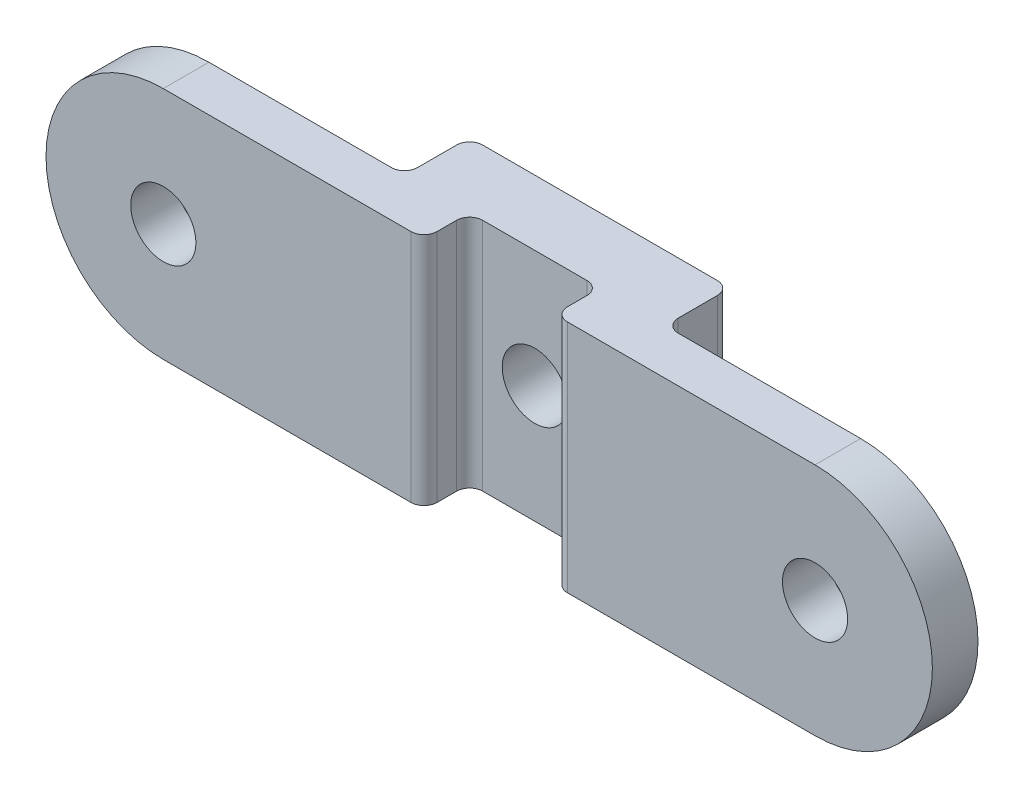
ISO-10303-21;
HEADER;
FILE_DESCRIPTION(('STEP AP214'),'2;1');
FILE_NAME('part.step','',(''),(''),'','','');
FILE_SCHEMA(('AUTOMOTIVE_DESIGN { 1 0 10303 214 1 1 1 1 }'));
ENDSEC;
DATA;
#1=APPLICATION_CONTEXT('core data for automotive mechanical design processes');
#2=APPLICATION_PROTOCOL_DEFINITION('international standard','automotive_design',2000,#1);
#3=PRODUCT_CONTEXT('',#1,'mechanical');
#4=PRODUCT('Part','Part','',(#3));
#5=PRODUCT_RELATED_PRODUCT_CATEGORY('part','',(#4));
#6=PRODUCT_DEFINITION_FORMATION('','',#4);
#7=PRODUCT_DEFINITION_CONTEXT('part definition',#1,'design');
#8=PRODUCT_DEFINITION('design','',#6,#7);
#9=PRODUCT_DEFINITION_SHAPE('','',#8);
#10=(LENGTH_UNIT() NAMED_UNIT(*) SI_UNIT(.MILLI.,.METRE.));
#11=(NAMED_UNIT(*) PLANE_ANGLE_UNIT() SI_UNIT($,.RADIAN.));
#12=(NAMED_UNIT(*) SI_UNIT($,.STERADIAN.) SOLID_ANGLE_UNIT());
#13=UNCERTAINTY_MEASURE_WITH_UNIT(LENGTH_MEASURE(1.E-05),#10,'distance_accuracy_value','');
#14=(GEOMETRIC_REPRESENTATION_CONTEXT(3) GLOBAL_UNCERTAINTY_ASSIGNED_CONTEXT((#13)) GLOBAL_UNIT_ASSIGNED_CONTEXT((#10,
#11,#12)) REPRESENTATION_CONTEXT('',''));
#15=CARTESIAN_POINT('',(0.,0.,0.));
#16=DIRECTION('',(0.,0.,1.));
#17=DIRECTION('',(1.,0.,0.));
#18=AXIS2_PLACEMENT_3D('',#15,#16,#17);
#19=CARTESIAN_POINT('',(-10.,9.,5.));
#20=DIRECTION('',(0.,-1.,0.));
#21=DIRECTION('',(0.,0.,-1.));
#22=AXIS2_PLACEMENT_3D('',#19,#20,#21);
#23=PLANE('',#22);
#24=DIRECTION('',(0.,0.,1.));
#25=VECTOR('',#24,1.);
#26=CARTESIAN_POINT('',(-25.,9.,-1.5));
#27=LINE('',#26,#25);
#28=CARTESIAN_POINT('',(-25.,8.99999999999999,5.));
#29=VERTEX_POINT('',#28);
#30=CARTESIAN_POINT('',(-25.,9.,8.5));
#31=VERTEX_POINT('',#30);
#32=EDGE_CURVE('E50',#29,#31,#27,.T.);
#33=ORIENTED_EDGE('',*,*,#32,.T.);
#34=DIRECTION('',(-1.,0.,0.));
#35=VECTOR('',#34,1.);
#36=CARTESIAN_POINT('',(-35.,9.,8.5));
#37=LINE('',#36,#35);
#38=CARTESIAN_POINT('',(-6.,9.,8.5));
#39=VERTEX_POINT('',#38);
#40=EDGE_CURVE('E210',#39,#31,#37,.T.);
#41=ORIENTED_EDGE('',*,*,#40,.F.);
#42=CARTESIAN_POINT('',(-6.,9.,7.5));
#43=DIRECTION('',(0.,-1.,0.));
#44=DIRECTION('',(0.,0.,-1.));
#45=AXIS2_PLACEMENT_3D('',#42,#43,#44);
#46=CIRCLE('',#45,1.);
#47=CARTESIAN_POINT('',(-5.,9.,7.5));
#48=VERTEX_POINT('',#47);
#49=EDGE_CURVE('E280',#39,#48,#46,.F.);
#50=ORIENTED_EDGE('',*,*,#49,.T.);
#51=DIRECTION('',(0.,0.,1.));
#52=VECTOR('',#51,1.);
#53=CARTESIAN_POINT('',(-5.,9.,5.));
#54=LINE('',#53,#52);
#55=CARTESIAN_POINT('',(-5.,9.,6.));
#56=VERTEX_POINT('',#55);
#57=EDGE_CURVE('E206',#56,#48,#54,.T.);
#58=ORIENTED_EDGE('',*,*,#57,.F.);
#59=CARTESIAN_POINT('',(-4.,9.,6.));
#60=DIRECTION('',(0.,-1.,0.));
#61=DIRECTION('',(0.,0.,-1.));
#62=AXIS2_PLACEMENT_3D('',#59,#60,#61);
#63=CIRCLE('',#62,1.);
#64=CARTESIAN_POINT('',(-4.,9.,5.));
#65=VERTEX_POINT('',#64);
#66=EDGE_CURVE('E315',#56,#65,#63,.T.);
#67=ORIENTED_EDGE('',*,*,#66,.T.);
#68=DIRECTION('',(-1.,0.,0.));
#69=VECTOR('',#68,1.);
#70=CARTESIAN_POINT('',(-10.,9.,5.));
#71=LINE('',#70,#69);
#72=CARTESIAN_POINT('',(4.,9.,5.));
#73=VERTEX_POINT('',#72);
#74=EDGE_CURVE('E226',#73,#65,#71,.T.);
#75=ORIENTED_EDGE('',*,*,#74,.F.);
#76=CARTESIAN_POINT('',(4.,9.,6.));
#77=DIRECTION('',(0.,-1.,0.));
#78=DIRECTION('',(0.,0.,-1.));
#79=AXIS2_PLACEMENT_3D('',#76,#77,#78);
#80=CIRCLE('',#79,1.);
#81=CARTESIAN_POINT('',(5.,9.,6.));
#82=VERTEX_POINT('',#81);
#83=EDGE_CURVE('E44',#73,#82,#80,.T.);
#84=ORIENTED_EDGE('',*,*,#83,.T.);
#85=DIRECTION('',(0.,0.,-1.));
#86=VECTOR('',#85,1.);
#87=CARTESIAN_POINT('',(5.,9.,5.));
#88=LINE('',#87,#86);
#89=CARTESIAN_POINT('',(5.,9.,7.5));
#90=VERTEX_POINT('',#89);
#91=EDGE_CURVE('E324',#90,#82,#88,.T.);
#92=ORIENTED_EDGE('',*,*,#91,.F.);
#93=CARTESIAN_POINT('',(5.99999999999999,9.,7.5));
#94=DIRECTION('',(0.,-1.,0.));
#95=DIRECTION('',(0.,0.,-1.));
#96=AXIS2_PLACEMENT_3D('',#93,#94,#95);
#97=CIRCLE('',#96,1.);
#98=CARTESIAN_POINT('',(5.99999999999999,9.,8.5));
#99=VERTEX_POINT('',#98);
#100=EDGE_CURVE('E277',#90,#99,#97,.F.);
#101=ORIENTED_EDGE('',*,*,#100,.T.);
#102=DIRECTION('',(-1.,0.,0.));
#103=VECTOR('',#102,1.);
#104=CARTESIAN_POINT('',(35.,9.,8.5));
#105=LINE('',#104,#103);
#106=CARTESIAN_POINT('',(25.,9.,8.5));
#107=VERTEX_POINT('',#106);
#108=EDGE_CURVE('E203',#107,#99,#105,.T.);
#109=ORIENTED_EDGE('',*,*,#108,.F.);
#110=DIRECTION('',(0.,0.,1.));
#111=VECTOR('',#110,1.);
#112=CARTESIAN_POINT('',(25.,9.,-1.5));
#113=LINE('',#112,#111);
#114=CARTESIAN_POINT('',(25.,9.,5.));
#115=VERTEX_POINT('',#114);
#116=EDGE_CURVE('E58',#115,#107,#113,.T.);
#117=ORIENTED_EDGE('',*,*,#116,.F.);
#118=DIRECTION('',(1.,0.,0.));
#119=VECTOR('',#118,1.);
#120=CARTESIAN_POINT('',(35.,9.,5.));
#121=LINE('',#120,#119);
#122=CARTESIAN_POINT('',(11.,9.,5.));
#123=VERTEX_POINT('',#122);
#124=EDGE_CURVE('E199',#123,#115,#121,.T.);
#125=ORIENTED_EDGE('',*,*,#124,.F.);
#126=CARTESIAN_POINT('',(11.,9.,4.));
#127=DIRECTION('',(0.,-1.,0.));
#128=DIRECTION('',(0.,0.,-1.));
#129=AXIS2_PLACEMENT_3D('',#126,#127,#128);
#130=CIRCLE('',#129,1.);
#131=CARTESIAN_POINT('',(10.,9.,4.));
#132=VERTEX_POINT('',#131);
#133=EDGE_CURVE('E304',#123,#132,#130,.T.);
#134=ORIENTED_EDGE('',*,*,#133,.T.);
#135=DIRECTION('',(0.,0.,-1.));
#136=VECTOR('',#135,1.);
#137=CARTESIAN_POINT('',(10.,9.,5.));
#138=LINE('',#137,#136);
#139=CARTESIAN_POINT('',(10.,9.,1.));
#140=VERTEX_POINT('',#139);
#141=EDGE_CURVE('E246',#132,#140,#138,.T.);
#142=ORIENTED_EDGE('',*,*,#141,.T.);
#143=CARTESIAN_POINT('',(9.,9.,1.));
#144=DIRECTION('',(0.,-1.,0.));
#145=DIRECTION('',(0.,0.,-1.));
#146=AXIS2_PLACEMENT_3D('',#143,#144,#145);
#147=CIRCLE('',#146,1.);
#148=CARTESIAN_POINT('',(9.,9.,0.));
#149=VERTEX_POINT('',#148);
#150=EDGE_CURVE('E282',#140,#149,#147,.F.);
#151=ORIENTED_EDGE('',*,*,#150,.T.);
#152=DIRECTION('',(-1.,0.,0.));
#153=VECTOR('',#152,1.);
#154=CARTESIAN_POINT('',(-10.,9.,0.));
#155=LINE('',#154,#153);
#156=CARTESIAN_POINT('',(-9.,9.,0.));
#157=VERTEX_POINT('',#156);
#158=EDGE_CURVE('E223',#149,#157,#155,.T.);
#159=ORIENTED_EDGE('',*,*,#158,.T.);
#160=CARTESIAN_POINT('',(-9.,9.,1.));
#161=DIRECTION('',(0.,-1.,0.));
#162=DIRECTION('',(0.,0.,-1.));
#163=AXIS2_PLACEMENT_3D('',#160,#161,#162);
#164=CIRCLE('',#163,1.);
#165=CARTESIAN_POINT('',(-10.,9.,1.));
#166=VERTEX_POINT('',#165);
#167=EDGE_CURVE('E284',#157,#166,#164,.F.);
#168=ORIENTED_EDGE('',*,*,#167,.T.);
#169=DIRECTION('',(0.,0.,-1.));
#170=VECTOR('',#169,1.);
#171=CARTESIAN_POINT('',(-10.,9.,5.));
#172=LINE('',#171,#170);
#173=CARTESIAN_POINT('',(-10.,9.,4.));
#174=VERTEX_POINT('',#173);
#175=EDGE_CURVE('E243',#174,#166,#172,.T.);
#176=ORIENTED_EDGE('',*,*,#175,.F.);
#177=CARTESIAN_POINT('',(-11.,9.,4.));
#178=DIRECTION('',(0.,-1.,0.));
#179=DIRECTION('',(0.,0.,-1.));
#180=AXIS2_PLACEMENT_3D('',#177,#178,#179);
#181=CIRCLE('',#180,1.);
#182=CARTESIAN_POINT('',(-11.,9.,5.));
#183=VERTEX_POINT('',#182);
#184=EDGE_CURVE('E310',#174,#183,#181,.T.);
#185=ORIENTED_EDGE('',*,*,#184,.T.);
#186=DIRECTION('',(1.,0.,0.));
#187=VECTOR('',#186,1.);
#188=CARTESIAN_POINT('',(-35.,9.,5.));
#189=LINE('',#188,#187);
#190=EDGE_CURVE('E204',#29,#183,#189,.T.);
#191=ORIENTED_EDGE('',*,*,#190,.F.);
#192=EDGE_LOOP('',(#33,#41,#50,#58,#67,#75,#84,#92,#101,#109,#117,#125,#134,#142,#151,#159,#168,
#176,#185,#191));
#193=FACE_BOUND('',#192,.T.);
#194=ADVANCED_FACE('F36',(#193),#23,.F.);
#195=CARTESIAN_POINT('',(-10.,-9.,5.));
#196=DIRECTION('',(0.,1.,0.));
#197=DIRECTION('',(0.,0.,1.));
#198=AXIS2_PLACEMENT_3D('',#195,#196,#197);
#199=PLANE('',#198);
#200=DIRECTION('',(-1.,0.,0.));
#201=VECTOR('',#200,1.);
#202=CARTESIAN_POINT('',(-35.,-9.,8.5));
#203=LINE('',#202,#201);
#204=CARTESIAN_POINT('',(-6.,-9.,8.5));
#205=VERTEX_POINT('',#204);
#206=CARTESIAN_POINT('',(-25.,-9.00000000000001,8.5));
#207=VERTEX_POINT('',#206);
#208=EDGE_CURVE('E207',#205,#207,#203,.T.);
#209=ORIENTED_EDGE('',*,*,#208,.T.);
#210=DIRECTION('',(0.,0.,1.));
#211=VECTOR('',#210,1.);
#212=CARTESIAN_POINT('',(-25.,-9.00000000000001,-1.5));
#213=LINE('',#212,#211);
#214=CARTESIAN_POINT('',(-25.,-9.00000000000001,5.));
#215=VERTEX_POINT('',#214);
#216=EDGE_CURVE('E359',#215,#207,#213,.T.);
#217=ORIENTED_EDGE('',*,*,#216,.F.);
#218=DIRECTION('',(1.,0.,0.));
#219=VECTOR('',#218,1.);
#220=CARTESIAN_POINT('',(-35.,-9.,5.));
#221=LINE('',#220,#219);
#222=CARTESIAN_POINT('',(-11.,-9.,5.));
#223=VERTEX_POINT('',#222);
#224=EDGE_CURVE('E214',#215,#223,#221,.T.);
#225=ORIENTED_EDGE('',*,*,#224,.T.);
#226=CARTESIAN_POINT('',(-11.,-9.,4.));
#227=DIRECTION('',(0.,1.,0.));
#228=DIRECTION('',(0.,0.,1.));
#229=AXIS2_PLACEMENT_3D('',#226,#227,#228);
#230=CIRCLE('',#229,1.);
#231=CARTESIAN_POINT('',(-10.,-9.,4.));
#232=VERTEX_POINT('',#231);
#233=EDGE_CURVE('E308',#223,#232,#230,.T.);
#234=ORIENTED_EDGE('',*,*,#233,.T.);
#235=DIRECTION('',(0.,0.,-1.));
#236=VECTOR('',#235,1.);
#237=CARTESIAN_POINT('',(-10.,-9.,5.));
#238=LINE('',#237,#236);
#239=CARTESIAN_POINT('',(-10.,-9.,1.));
#240=VERTEX_POINT('',#239);
#241=EDGE_CURVE('E240',#232,#240,#238,.T.);
#242=ORIENTED_EDGE('',*,*,#241,.T.);
#243=CARTESIAN_POINT('',(-9.,-9.,1.));
#244=DIRECTION('',(0.,1.,0.));
#245=DIRECTION('',(0.,0.,1.));
#246=AXIS2_PLACEMENT_3D('',#243,#244,#245);
#247=CIRCLE('',#246,1.);
#248=CARTESIAN_POINT('',(-9.,-9.,0.));
#249=VERTEX_POINT('',#248);
#250=EDGE_CURVE('E271',#240,#249,#247,.F.);
#251=ORIENTED_EDGE('',*,*,#250,.T.);
#252=DIRECTION('',(1.,0.,0.));
#253=VECTOR('',#252,1.);
#254=CARTESIAN_POINT('',(-10.,-9.,0.));
#255=LINE('',#254,#253);
#256=CARTESIAN_POINT('',(9.,-9.,0.));
#257=VERTEX_POINT('',#256);
#258=EDGE_CURVE('E230',#249,#257,#255,.T.);
#259=ORIENTED_EDGE('',*,*,#258,.T.);
#260=CARTESIAN_POINT('',(9.,-9.,1.));
#261=DIRECTION('',(0.,1.,0.));
#262=DIRECTION('',(0.,0.,1.));
#263=AXIS2_PLACEMENT_3D('',#260,#261,#262);
#264=CIRCLE('',#263,1.);
#265=CARTESIAN_POINT('',(10.,-9.,1.));
#266=VERTEX_POINT('',#265);
#267=EDGE_CURVE('E269',#257,#266,#264,.F.);
#268=ORIENTED_EDGE('',*,*,#267,.T.);
#269=DIRECTION('',(0.,0.,-1.));
#270=VECTOR('',#269,1.);
#271=CARTESIAN_POINT('',(10.,-9.,5.));
#272=LINE('',#271,#270);
#273=CARTESIAN_POINT('',(10.,-9.,4.));
#274=VERTEX_POINT('',#273);
#275=EDGE_CURVE('E233',#274,#266,#272,.T.);
#276=ORIENTED_EDGE('',*,*,#275,.F.);
#277=CARTESIAN_POINT('',(11.,-9.,4.));
#278=DIRECTION('',(0.,1.,0.));
#279=DIRECTION('',(0.,0.,1.));
#280=AXIS2_PLACEMENT_3D('',#277,#278,#279);
#281=CIRCLE('',#280,1.);
#282=CARTESIAN_POINT('',(11.,-9.,5.));
#283=VERTEX_POINT('',#282);
#284=EDGE_CURVE('E306',#274,#283,#281,.T.);
#285=ORIENTED_EDGE('',*,*,#284,.T.);
#286=DIRECTION('',(1.,0.,0.));
#287=VECTOR('',#286,1.);
#288=CARTESIAN_POINT('',(35.,-9.,5.));
#289=LINE('',#288,#287);
#290=CARTESIAN_POINT('',(25.,-9.00000000000001,5.));
#291=VERTEX_POINT('',#290);
#292=EDGE_CURVE('E185',#283,#291,#289,.T.);
#293=ORIENTED_EDGE('',*,*,#292,.T.);
#294=DIRECTION('',(0.,0.,1.));
#295=VECTOR('',#294,1.);
#296=CARTESIAN_POINT('',(25.,-9.00000000000001,-1.5));
#297=LINE('',#296,#295);
#298=CARTESIAN_POINT('',(25.,-9.00000000000001,8.5));
#299=VERTEX_POINT('',#298);
#300=EDGE_CURVE('E172',#291,#299,#297,.T.);
#301=ORIENTED_EDGE('',*,*,#300,.T.);
#302=DIRECTION('',(-1.,0.,0.));
#303=VECTOR('',#302,1.);
#304=CARTESIAN_POINT('',(35.,-9.,8.5));
#305=LINE('',#304,#303);
#306=CARTESIAN_POINT('',(5.99999999999999,-9.,8.5));
#307=VERTEX_POINT('',#306);
#308=EDGE_CURVE('E182',#299,#307,#305,.T.);
#309=ORIENTED_EDGE('',*,*,#308,.T.);
#310=CARTESIAN_POINT('',(5.99999999999999,-9.,7.5));
#311=DIRECTION('',(0.,1.,0.));
#312=DIRECTION('',(0.,0.,1.));
#313=AXIS2_PLACEMENT_3D('',#310,#311,#312);
#314=CIRCLE('',#313,1.);
#315=CARTESIAN_POINT('',(5.,-9.,7.5));
#316=VERTEX_POINT('',#315);
#317=EDGE_CURVE('E265',#307,#316,#314,.F.);
#318=ORIENTED_EDGE('',*,*,#317,.T.);
#319=DIRECTION('',(0.,0.,-1.));
#320=VECTOR('',#319,1.);
#321=CARTESIAN_POINT('',(5.,-9.,5.));
#322=LINE('',#321,#320);
#323=CARTESIAN_POINT('',(5.,-9.,6.));
#324=VERTEX_POINT('',#323);
#325=EDGE_CURVE('E191',#316,#324,#322,.T.);
#326=ORIENTED_EDGE('',*,*,#325,.T.);
#327=CARTESIAN_POINT('',(4.,-9.,6.));
#328=DIRECTION('',(0.,1.,0.));
#329=DIRECTION('',(0.,0.,1.));
#330=AXIS2_PLACEMENT_3D('',#327,#328,#329);
#331=CIRCLE('',#330,1.);
#332=CARTESIAN_POINT('',(4.,-9.,5.));
#333=VERTEX_POINT('',#332);
#334=EDGE_CURVE('E317',#324,#333,#331,.T.);
#335=ORIENTED_EDGE('',*,*,#334,.T.);
#336=DIRECTION('',(1.,0.,0.));
#337=VECTOR('',#336,1.);
#338=CARTESIAN_POINT('',(-10.,-9.,5.));
#339=LINE('',#338,#337);
#340=CARTESIAN_POINT('',(-4.,-9.,5.));
#341=VERTEX_POINT('',#340);
#342=EDGE_CURVE('E229',#341,#333,#339,.T.);
#343=ORIENTED_EDGE('',*,*,#342,.F.);
#344=CARTESIAN_POINT('',(-4.,-9.,6.));
#345=DIRECTION('',(0.,1.,0.));
#346=DIRECTION('',(0.,0.,1.));
#347=AXIS2_PLACEMENT_3D('',#344,#345,#346);
#348=CIRCLE('',#347,1.);
#349=CARTESIAN_POINT('',(-5.,-9.,6.));
#350=VERTEX_POINT('',#349);
#351=EDGE_CURVE('E313',#341,#350,#348,.T.);
#352=ORIENTED_EDGE('',*,*,#351,.T.);
#353=DIRECTION('',(0.,0.,1.));
#354=VECTOR('',#353,1.);
#355=CARTESIAN_POINT('',(-5.,-9.,5.));
#356=LINE('',#355,#354);
#357=CARTESIAN_POINT('',(-5.,-9.,7.5));
#358=VERTEX_POINT('',#357);
#359=EDGE_CURVE('E216',#350,#358,#356,.T.);
#360=ORIENTED_EDGE('',*,*,#359,.T.);
#361=CARTESIAN_POINT('',(-6.,-9.,7.5));
#362=DIRECTION('',(0.,1.,0.));
#363=DIRECTION('',(0.,0.,1.));
#364=AXIS2_PLACEMENT_3D('',#361,#362,#363);
#365=CIRCLE('',#364,1.);
#366=EDGE_CURVE('E267',#358,#205,#365,.F.);
#367=ORIENTED_EDGE('',*,*,#366,.T.);
#368=EDGE_LOOP('',(#209,#217,#225,#234,#242,#251,#259,#268,#276,#285,#293,#301,#309,#318,#326,
#335,#343,#352,#360,#367));
#369=FACE_BOUND('',#368,.T.);
#370=ADVANCED_FACE('F181',(#369),#199,.F.);
#371=CARTESIAN_POINT('',(0.,0.,5.));
#372=DIRECTION('',(0.,0.,-1.));
#373=DIRECTION('',(-1.,0.,0.));
#374=AXIS2_PLACEMENT_3D('',#371,#372,#373);
#375=PLANE('',#374);
#376=ORIENTED_EDGE('',*,*,#74,.T.);
#377=DIRECTION('',(0.,-1.,0.));
#378=VECTOR('',#377,1.);
#379=CARTESIAN_POINT('',(-4.,0.,5.));
#380=LINE('',#379,#378);
#381=EDGE_CURVE('E301',#65,#341,#380,.T.);
#382=ORIENTED_EDGE('',*,*,#381,.T.);
#383=ORIENTED_EDGE('',*,*,#342,.T.);
#384=DIRECTION('',(0.,-1.,0.));
#385=VECTOR('',#384,1.);
#386=CARTESIAN_POINT('',(4.,0.,5.));
#387=LINE('',#386,#385);
#388=EDGE_CURVE('E299',#333,#73,#387,.F.);
#389=ORIENTED_EDGE('',*,*,#388,.T.);
#390=EDGE_LOOP('',(#376,#382,#383,#389));
#391=FACE_BOUND('',#390,.T.);
#392=CARTESIAN_POINT('',(0.,0.,5.));
#393=DIRECTION('',(0.,0.,1.));
#394=DIRECTION('',(1.,0.,0.));
#395=AXIS2_PLACEMENT_3D('',#392,#393,#394);
#396=CIRCLE('',#395,2.5);
#397=CARTESIAN_POINT('',(2.5,0.,5.));
#398=VERTEX_POINT('',#397);
#399=EDGE_CURVE('E220',#398,#398,#396,.T.);
#400=ORIENTED_EDGE('',*,*,#399,.F.);
#401=EDGE_LOOP('',(#400));
#402=FACE_BOUND('',#401,.T.);
#403=ADVANCED_FACE('F335',(#391,#402),#375,.F.);
#404=CARTESIAN_POINT('',(0.,0.,0.));
#405=DIRECTION('',(0.,0.,-1.));
#406=DIRECTION('',(-1.,0.,0.));
#407=AXIS2_PLACEMENT_3D('',#404,#405,#406);
#408=PLANE('',#407);
#409=ORIENTED_EDGE('',*,*,#258,.F.);
#410=DIRECTION('',(0.,-1.,0.));
#411=VECTOR('',#410,1.);
#412=CARTESIAN_POINT('',(-9.,9.,0.));
#413=LINE('',#412,#411);
#414=EDGE_CURVE('E275',#249,#157,#413,.F.);
#415=ORIENTED_EDGE('',*,*,#414,.T.);
#416=ORIENTED_EDGE('',*,*,#158,.F.);
#417=DIRECTION('',(0.,1.,0.));
#418=VECTOR('',#417,1.);
#419=CARTESIAN_POINT('',(9.,-9.,0.));
#420=LINE('',#419,#418);
#421=EDGE_CURVE('E273',#149,#257,#420,.F.);
#422=ORIENTED_EDGE('',*,*,#421,.T.);
#423=EDGE_LOOP('',(#409,#415,#416,#422));
#424=FACE_BOUND('',#423,.T.);
#425=CARTESIAN_POINT('',(0.,0.,0.));
#426=DIRECTION('',(0.,0.,1.));
#427=DIRECTION('',(1.,0.,0.));
#428=AXIS2_PLACEMENT_3D('',#425,#426,#427);
#429=CIRCLE('',#428,2.5);
#430=CARTESIAN_POINT('',(2.5,0.,0.));
#431=VERTEX_POINT('',#430);
#432=EDGE_CURVE('E213',#431,#431,#429,.T.);
#433=ORIENTED_EDGE('',*,*,#432,.T.);
#434=EDGE_LOOP('',(#433));
#435=FACE_BOUND('',#434,.T.);
#436=ADVANCED_FACE('F396',(#424,#435),#408,.T.);
#437=CARTESIAN_POINT('',(10.,-9.,5.));
#438=DIRECTION('',(-1.,0.,0.));
#439=DIRECTION('',(0.,0.,1.));
#440=AXIS2_PLACEMENT_3D('',#437,#438,#439);
#441=PLANE('',#440);
#442=ORIENTED_EDGE('',*,*,#141,.F.);
#443=DIRECTION('',(0.,1.,0.));
#444=VECTOR('',#443,1.);
#445=CARTESIAN_POINT('',(10.,-9.,4.));
#446=LINE('',#445,#444);
#447=EDGE_CURVE('E255',#132,#274,#446,.F.);
#448=ORIENTED_EDGE('',*,*,#447,.T.);
#449=ORIENTED_EDGE('',*,*,#275,.T.);
#450=DIRECTION('',(0.,1.,0.));
#451=VECTOR('',#450,1.);
#452=CARTESIAN_POINT('',(10.,9.,1.));
#453=LINE('',#452,#451);
#454=EDGE_CURVE('E252',#266,#140,#453,.T.);
#455=ORIENTED_EDGE('',*,*,#454,.T.);
#456=EDGE_LOOP('',(#442,#448,#449,#455));
#457=FACE_BOUND('',#456,.T.);
#458=ADVANCED_FACE('F393',(#457),#441,.F.);
#459=CARTESIAN_POINT('',(-10.,-9.,5.));
#460=DIRECTION('',(1.,0.,0.));
#461=DIRECTION('',(0.,0.,-1.));
#462=AXIS2_PLACEMENT_3D('',#459,#460,#461);
#463=PLANE('',#462);
#464=ORIENTED_EDGE('',*,*,#241,.F.);
#465=DIRECTION('',(0.,-1.,0.));
#466=VECTOR('',#465,1.);
#467=CARTESIAN_POINT('',(-10.,-9.,4.));
#468=LINE('',#467,#466);
#469=EDGE_CURVE('E263',#232,#174,#468,.F.);
#470=ORIENTED_EDGE('',*,*,#469,.T.);
#471=ORIENTED_EDGE('',*,*,#175,.T.);
#472=DIRECTION('',(0.,-1.,0.));
#473=VECTOR('',#472,1.);
#474=CARTESIAN_POINT('',(-10.,-9.,1.));
#475=LINE('',#474,#473);
#476=EDGE_CURVE('E260',#166,#240,#475,.T.);
#477=ORIENTED_EDGE('',*,*,#476,.T.);
#478=EDGE_LOOP('',(#464,#470,#471,#477));
#479=FACE_BOUND('',#478,.T.);
#480=ADVANCED_FACE('F392',(#479),#463,.F.);
#481=CARTESIAN_POINT('',(0.,0.,5.));
#482=DIRECTION('',(0.,0.,-1.));
#483=DIRECTION('',(-1.,0.,0.));
#484=AXIS2_PLACEMENT_3D('',#481,#482,#483);
#485=CYLINDRICAL_SURFACE('',#484,2.5);
#486=ORIENTED_EDGE('',*,*,#399,.T.);
#487=EDGE_LOOP('',(#486));
#488=FACE_BOUND('',#487,.T.);
#489=ORIENTED_EDGE('',*,*,#432,.F.);
#490=EDGE_LOOP('',(#489));
#491=FACE_BOUND('',#490,.T.);
#492=ADVANCED_FACE('F468',(#488,#491),#485,.F.);
#493=CARTESIAN_POINT('',(-35.,9.,8.5));
#494=DIRECTION('',(0.,0.,1.));
#495=DIRECTION('',(1.,0.,0.));
#496=AXIS2_PLACEMENT_3D('',#493,#494,#495);
#497=PLANE('',#496);
#498=CARTESIAN_POINT('',(-25.,0.,8.5));
#499=DIRECTION('',(0.,0.,-1.));
#500=DIRECTION('',(-1.,0.,0.));
#501=AXIS2_PLACEMENT_3D('',#498,#499,#500);
#502=CIRCLE('',#501,9.);
#503=EDGE_CURVE('E358',#207,#31,#502,.T.);
#504=ORIENTED_EDGE('',*,*,#503,.F.);
#505=ORIENTED_EDGE('',*,*,#208,.F.);
#506=DIRECTION('',(0.,-1.,0.));
#507=VECTOR('',#506,1.);
#508=CARTESIAN_POINT('',(-6.,9.,8.5));
#509=LINE('',#508,#507);
#510=EDGE_CURVE('E291',#205,#39,#509,.F.);
#511=ORIENTED_EDGE('',*,*,#510,.T.);
#512=ORIENTED_EDGE('',*,*,#40,.T.);
#513=EDGE_LOOP('',(#504,#505,#511,#512));
#514=FACE_BOUND('',#513,.T.);
#515=CARTESIAN_POINT('',(-25.,0.,8.5));
#516=DIRECTION('',(0.,0.,1.));
#517=DIRECTION('',(1.,0.,0.));
#518=AXIS2_PLACEMENT_3D('',#515,#516,#517);
#519=CIRCLE('',#518,2.5);
#520=CARTESIAN_POINT('',(-22.5,0.,8.5));
#521=VERTEX_POINT('',#520);
#522=EDGE_CURVE('E367',#521,#521,#519,.T.);
#523=ORIENTED_EDGE('',*,*,#522,.F.);
#524=EDGE_LOOP('',(#523));
#525=FACE_BOUND('',#524,.T.);
#526=ADVANCED_FACE('F355',(#514,#525),#497,.T.);
#527=CARTESIAN_POINT('',(-5.,9.,5.));
#528=DIRECTION('',(1.,0.,0.));
#529=DIRECTION('',(0.,0.,-1.));
#530=AXIS2_PLACEMENT_3D('',#527,#528,#529);
#531=PLANE('',#530);
#532=ORIENTED_EDGE('',*,*,#57,.T.);
#533=DIRECTION('',(0.,-1.,0.));
#534=VECTOR('',#533,1.);
#535=CARTESIAN_POINT('',(-5.,9.,7.5));
#536=LINE('',#535,#534);
#537=EDGE_CURVE('E288',#48,#358,#536,.T.);
#538=ORIENTED_EDGE('',*,*,#537,.T.);
#539=ORIENTED_EDGE('',*,*,#359,.F.);
#540=DIRECTION('',(0.,-1.,0.));
#541=VECTOR('',#540,1.);
#542=CARTESIAN_POINT('',(-5.,9.,6.));
#543=LINE('',#542,#541);
#544=EDGE_CURVE('E286',#350,#56,#543,.F.);
#545=ORIENTED_EDGE('',*,*,#544,.T.);
#546=EDGE_LOOP('',(#532,#538,#539,#545));
#547=FACE_BOUND('',#546,.T.);
#548=ADVANCED_FACE('F344',(#547),#531,.T.);
#549=CARTESIAN_POINT('',(-35.,9.,5.));
#550=DIRECTION('',(0.,0.,-1.));
#551=DIRECTION('',(-1.,0.,0.));
#552=AXIS2_PLACEMENT_3D('',#549,#550,#551);
#553=PLANE('',#552);
#554=CARTESIAN_POINT('',(-25.,0.,5.));
#555=DIRECTION('',(0.,0.,-1.));
#556=DIRECTION('',(-1.,0.,0.));
#557=AXIS2_PLACEMENT_3D('',#554,#555,#556);
#558=CIRCLE('',#557,9.);
#559=EDGE_CURVE('E11',#29,#215,#558,.F.);
#560=ORIENTED_EDGE('',*,*,#559,.F.);
#561=ORIENTED_EDGE('',*,*,#190,.T.);
#562=DIRECTION('',(0.,-1.,0.));
#563=VECTOR('',#562,1.);
#564=CARTESIAN_POINT('',(-11.,9.,5.));
#565=LINE('',#564,#563);
#566=EDGE_CURVE('E257',#183,#223,#565,.T.);
#567=ORIENTED_EDGE('',*,*,#566,.T.);
#568=ORIENTED_EDGE('',*,*,#224,.F.);
#569=EDGE_LOOP('',(#560,#561,#567,#568));
#570=FACE_BOUND('',#569,.T.);
#571=CARTESIAN_POINT('',(-25.,0.,5.));
#572=DIRECTION('',(0.,0.,-1.));
#573=DIRECTION('',(-1.,0.,0.));
#574=AXIS2_PLACEMENT_3D('',#571,#572,#573);
#575=CIRCLE('',#574,2.5);
#576=CARTESIAN_POINT('',(-27.5,0.,5.));
#577=VERTEX_POINT('',#576);
#578=EDGE_CURVE('E192',#577,#577,#575,.T.);
#579=ORIENTED_EDGE('',*,*,#578,.F.);
#580=EDGE_LOOP('',(#579));
#581=FACE_BOUND('',#580,.T.);
#582=ADVANCED_FACE('F442',(#570,#581),#553,.T.);
#583=CARTESIAN_POINT('',(35.,9.,5.));
#584=DIRECTION('',(0.,0.,-1.));
#585=DIRECTION('',(-1.,0.,0.));
#586=AXIS2_PLACEMENT_3D('',#583,#584,#585);
#587=PLANE('',#586);
#588=CARTESIAN_POINT('',(25.,0.,5.));
#589=DIRECTION('',(0.,0.,-1.));
#590=DIRECTION('',(-1.,0.,0.));
#591=AXIS2_PLACEMENT_3D('',#588,#589,#590);
#592=CIRCLE('',#591,2.5);
#593=CARTESIAN_POINT('',(22.5,0.,5.));
#594=VERTEX_POINT('',#593);
#595=EDGE_CURVE('E197',#594,#594,#592,.T.);
#596=ORIENTED_EDGE('',*,*,#595,.F.);
#597=EDGE_LOOP('',(#596));
#598=FACE_BOUND('',#597,.T.);
#599=CARTESIAN_POINT('',(25.,0.,5.));
#600=DIRECTION('',(0.,0.,-1.));
#601=DIRECTION('',(-1.,0.,0.));
#602=AXIS2_PLACEMENT_3D('',#599,#600,#601);
#603=CIRCLE('',#602,9.);
#604=EDGE_CURVE('E370',#291,#115,#603,.F.);
#605=ORIENTED_EDGE('',*,*,#604,.F.);
#606=ORIENTED_EDGE('',*,*,#292,.F.);
#607=DIRECTION('',(0.,1.,0.));
#608=VECTOR('',#607,1.);
#609=CARTESIAN_POINT('',(11.,9.,5.));
#610=LINE('',#609,#608);
#611=EDGE_CURVE('E249',#283,#123,#610,.T.);
#612=ORIENTED_EDGE('',*,*,#611,.T.);
#613=ORIENTED_EDGE('',*,*,#124,.T.);
#614=EDGE_LOOP('',(#605,#606,#612,#613));
#615=FACE_BOUND('',#614,.T.);
#616=ADVANCED_FACE('F424',(#598,#615),#587,.T.);
#617=CARTESIAN_POINT('',(5.,9.,5.));
#618=DIRECTION('',(-1.,0.,0.));
#619=DIRECTION('',(0.,0.,1.));
#620=AXIS2_PLACEMENT_3D('',#617,#618,#619);
#621=PLANE('',#620);
#622=ORIENTED_EDGE('',*,*,#325,.F.);
#623=DIRECTION('',(0.,-1.,0.));
#624=VECTOR('',#623,1.);
#625=CARTESIAN_POINT('',(5.,9.,7.5));
#626=LINE('',#625,#624);
#627=EDGE_CURVE('E297',#316,#90,#626,.F.);
#628=ORIENTED_EDGE('',*,*,#627,.T.);
#629=ORIENTED_EDGE('',*,*,#91,.T.);
#630=DIRECTION('',(0.,-1.,0.));
#631=VECTOR('',#630,1.);
#632=CARTESIAN_POINT('',(5.,9.,6.));
#633=LINE('',#632,#631);
#634=EDGE_CURVE('E294',#82,#324,#633,.T.);
#635=ORIENTED_EDGE('',*,*,#634,.T.);
#636=EDGE_LOOP('',(#622,#628,#629,#635));
#637=FACE_BOUND('',#636,.T.);
#638=ADVANCED_FACE('F331',(#637),#621,.T.);
#639=CARTESIAN_POINT('',(35.,9.,8.5));
#640=DIRECTION('',(0.,0.,1.));
#641=DIRECTION('',(1.,0.,0.));
#642=AXIS2_PLACEMENT_3D('',#639,#640,#641);
#643=PLANE('',#642);
#644=CARTESIAN_POINT('',(25.,0.,8.5));
#645=DIRECTION('',(0.,0.,1.));
#646=DIRECTION('',(-1.,0.,0.));
#647=AXIS2_PLACEMENT_3D('',#644,#645,#646);
#648=CIRCLE('',#647,2.5);
#649=CARTESIAN_POINT('',(22.5,0.,8.5));
#650=VERTEX_POINT('',#649);
#651=EDGE_CURVE('E365',#650,#650,#648,.T.);
#652=ORIENTED_EDGE('',*,*,#651,.F.);
#653=EDGE_LOOP('',(#652));
#654=FACE_BOUND('',#653,.T.);
#655=CARTESIAN_POINT('',(25.,0.,8.5));
#656=DIRECTION('',(0.,0.,-1.));
#657=DIRECTION('',(1.,0.,0.));
#658=AXIS2_PLACEMENT_3D('',#655,#656,#657);
#659=CIRCLE('',#658,9.);
#660=EDGE_CURVE('E169',#107,#299,#659,.T.);
#661=ORIENTED_EDGE('',*,*,#660,.F.);
#662=ORIENTED_EDGE('',*,*,#108,.T.);
#663=DIRECTION('',(0.,-1.,0.));
#664=VECTOR('',#663,1.);
#665=CARTESIAN_POINT('',(5.99999999999999,9.,8.5));
#666=LINE('',#665,#664);
#667=EDGE_CURVE('E190',#99,#307,#666,.T.);
#668=ORIENTED_EDGE('',*,*,#667,.T.);
#669=ORIENTED_EDGE('',*,*,#308,.F.);
#670=EDGE_LOOP('',(#661,#662,#668,#669));
#671=FACE_BOUND('',#670,.T.);
#672=ADVANCED_FACE('F188',(#654,#671),#643,.T.);
#673=CARTESIAN_POINT('',(11.,9.,4.));
#674=DIRECTION('',(0.,1.,0.));
#675=DIRECTION('',(0.,0.,1.));
#676=AXIS2_PLACEMENT_3D('',#673,#674,#675);
#677=CYLINDRICAL_SURFACE('',#676,1.);
#678=ORIENTED_EDGE('',*,*,#284,.F.);
#679=ORIENTED_EDGE('',*,*,#447,.F.);
#680=ORIENTED_EDGE('',*,*,#133,.F.);
#681=ORIENTED_EDGE('',*,*,#611,.F.);
#682=EDGE_LOOP('',(#678,#679,#680,#681));
#683=FACE_BOUND('',#682,.T.);
#684=ADVANCED_FACE('F398',(#683),#677,.F.);
#685=CARTESIAN_POINT('',(-11.,9.,4.));
#686=DIRECTION('',(0.,-1.,0.));
#687=DIRECTION('',(0.,0.,-1.));
#688=AXIS2_PLACEMENT_3D('',#685,#686,#687);
#689=CYLINDRICAL_SURFACE('',#688,1.);
#690=ORIENTED_EDGE('',*,*,#184,.F.);
#691=ORIENTED_EDGE('',*,*,#469,.F.);
#692=ORIENTED_EDGE('',*,*,#233,.F.);
#693=ORIENTED_EDGE('',*,*,#566,.F.);
#694=EDGE_LOOP('',(#690,#691,#692,#693));
#695=FACE_BOUND('',#694,.T.);
#696=ADVANCED_FACE('F401',(#695),#689,.F.);
#697=CARTESIAN_POINT('',(-9.,-9.,1.));
#698=DIRECTION('',(0.,1.,0.));
#699=DIRECTION('',(0.,0.,1.));
#700=AXIS2_PLACEMENT_3D('',#697,#698,#699);
#701=CYLINDRICAL_SURFACE('',#700,1.);
#702=ORIENTED_EDGE('',*,*,#167,.F.);
#703=ORIENTED_EDGE('',*,*,#414,.F.);
#704=ORIENTED_EDGE('',*,*,#250,.F.);
#705=ORIENTED_EDGE('',*,*,#476,.F.);
#706=EDGE_LOOP('',(#702,#703,#704,#705));
#707=FACE_BOUND('',#706,.T.);
#708=ADVANCED_FACE('F405',(#707),#701,.T.);
#709=CARTESIAN_POINT('',(9.,-9.,1.));
#710=DIRECTION('',(0.,-1.,0.));
#711=DIRECTION('',(0.,0.,-1.));
#712=AXIS2_PLACEMENT_3D('',#709,#710,#711);
#713=CYLINDRICAL_SURFACE('',#712,1.);
#714=ORIENTED_EDGE('',*,*,#267,.F.);
#715=ORIENTED_EDGE('',*,*,#421,.F.);
#716=ORIENTED_EDGE('',*,*,#150,.F.);
#717=ORIENTED_EDGE('',*,*,#454,.F.);
#718=EDGE_LOOP('',(#714,#715,#716,#717));
#719=FACE_BOUND('',#718,.T.);
#720=ADVANCED_FACE('F382',(#719),#713,.T.);
#721=CARTESIAN_POINT('',(-6.,9.,7.5));
#722=DIRECTION('',(0.,-1.,0.));
#723=DIRECTION('',(0.,0.,-1.));
#724=AXIS2_PLACEMENT_3D('',#721,#722,#723);
#725=CYLINDRICAL_SURFACE('',#724,1.);
#726=ORIENTED_EDGE('',*,*,#49,.F.);
#727=ORIENTED_EDGE('',*,*,#510,.F.);
#728=ORIENTED_EDGE('',*,*,#366,.F.);
#729=ORIENTED_EDGE('',*,*,#537,.F.);
#730=EDGE_LOOP('',(#726,#727,#728,#729));
#731=FACE_BOUND('',#730,.T.);
#732=ADVANCED_FACE('F349',(#731),#725,.T.);
#733=CARTESIAN_POINT('',(5.99999999999999,9.,7.5));
#734=DIRECTION('',(0.,-1.,0.));
#735=DIRECTION('',(0.,0.,-1.));
#736=AXIS2_PLACEMENT_3D('',#733,#734,#735);
#737=CYLINDRICAL_SURFACE('',#736,1.);
#738=ORIENTED_EDGE('',*,*,#100,.F.);
#739=ORIENTED_EDGE('',*,*,#627,.F.);
#740=ORIENTED_EDGE('',*,*,#317,.F.);
#741=ORIENTED_EDGE('',*,*,#667,.F.);
#742=EDGE_LOOP('',(#738,#739,#740,#741));
#743=FACE_BOUND('',#742,.T.);
#744=ADVANCED_FACE('F375',(#743),#737,.T.);
#745=CARTESIAN_POINT('',(-4.,0.,6.));
#746=DIRECTION('',(0.,-1.,0.));
#747=DIRECTION('',(0.,0.,-1.));
#748=AXIS2_PLACEMENT_3D('',#745,#746,#747);
#749=CYLINDRICAL_SURFACE('',#748,1.);
#750=ORIENTED_EDGE('',*,*,#66,.F.);
#751=ORIENTED_EDGE('',*,*,#544,.F.);
#752=ORIENTED_EDGE('',*,*,#351,.F.);
#753=ORIENTED_EDGE('',*,*,#381,.F.);
#754=EDGE_LOOP('',(#750,#751,#752,#753));
#755=FACE_BOUND('',#754,.T.);
#756=ADVANCED_FACE('F340',(#755),#749,.F.);
#757=CARTESIAN_POINT('',(4.,9.,6.));
#758=DIRECTION('',(0.,-1.,0.));
#759=DIRECTION('',(0.,0.,-1.));
#760=AXIS2_PLACEMENT_3D('',#757,#758,#759);
#761=CYLINDRICAL_SURFACE('',#760,1.);
#762=ORIENTED_EDGE('',*,*,#83,.F.);
#763=ORIENTED_EDGE('',*,*,#388,.F.);
#764=ORIENTED_EDGE('',*,*,#334,.F.);
#765=ORIENTED_EDGE('',*,*,#634,.F.);
#766=EDGE_LOOP('',(#762,#763,#764,#765));
#767=FACE_BOUND('',#766,.T.);
#768=ADVANCED_FACE('F38',(#767),#761,.F.);
#769=CARTESIAN_POINT('',(25.,0.,-1.5));
#770=DIRECTION('',(0.,0.,1.));
#771=DIRECTION('',(1.,0.,0.));
#772=AXIS2_PLACEMENT_3D('',#769,#770,#771);
#773=CYLINDRICAL_SURFACE('',#772,9.);
#774=ORIENTED_EDGE('',*,*,#604,.T.);
#775=ORIENTED_EDGE('',*,*,#116,.T.);
#776=ORIENTED_EDGE('',*,*,#660,.T.);
#777=ORIENTED_EDGE('',*,*,#300,.F.);
#778=EDGE_LOOP('',(#774,#775,#776,#777));
#779=FACE_BOUND('',#778,.T.);
#780=ADVANCED_FACE('F171',(#779),#773,.T.);
#781=CARTESIAN_POINT('',(25.,0.,-1.5));
#782=DIRECTION('',(0.,0.,1.));
#783=DIRECTION('',(1.,0.,0.));
#784=AXIS2_PLACEMENT_3D('',#781,#782,#783);
#785=CYLINDRICAL_SURFACE('',#784,2.5);
#786=ORIENTED_EDGE('',*,*,#595,.T.);
#787=EDGE_LOOP('',(#786));
#788=FACE_BOUND('',#787,.T.);
#789=ORIENTED_EDGE('',*,*,#651,.T.);
#790=EDGE_LOOP('',(#789));
#791=FACE_BOUND('',#790,.T.);
#792=ADVANCED_FACE('F452',(#788,#791),#785,.F.);
#793=CARTESIAN_POINT('',(-25.,0.,-1.5));
#794=DIRECTION('',(0.,0.,1.));
#795=DIRECTION('',(1.,0.,0.));
#796=AXIS2_PLACEMENT_3D('',#793,#794,#795);
#797=CYLINDRICAL_SURFACE('',#796,2.5);
#798=ORIENTED_EDGE('',*,*,#578,.T.);
#799=EDGE_LOOP('',(#798));
#800=FACE_BOUND('',#799,.T.);
#801=ORIENTED_EDGE('',*,*,#522,.T.);
#802=EDGE_LOOP('',(#801));
#803=FACE_BOUND('',#802,.T.);
#804=ADVANCED_FACE('F447',(#800,#803),#797,.F.);
#805=CARTESIAN_POINT('',(-25.,0.,-1.5));
#806=DIRECTION('',(0.,0.,1.));
#807=DIRECTION('',(1.,0.,0.));
#808=AXIS2_PLACEMENT_3D('',#805,#806,#807);
#809=CYLINDRICAL_SURFACE('',#808,9.);
#810=ORIENTED_EDGE('',*,*,#559,.T.);
#811=ORIENTED_EDGE('',*,*,#216,.T.);
#812=ORIENTED_EDGE('',*,*,#503,.T.);
#813=ORIENTED_EDGE('',*,*,#32,.F.);
#814=EDGE_LOOP('',(#810,#811,#812,#813));
#815=FACE_BOUND('',#814,.T.);
#816=ADVANCED_FACE('F445',(#815),#809,.T.);
#817=CLOSED_SHELL('',(#194,#370,#403,#436,#458,#480,#492,#526,#548,#582,#616,#638,#672,#684,
#696,#708,#720,#732,#744,#756,#768,#780,#792,#804,#816));
#818=MANIFOLD_SOLID_BREP('B2',#817);
#819=ADVANCED_BREP_SHAPE_REPRESENTATION('',(#18,#818),#14);
#820=SHAPE_DEFINITION_REPRESENTATION(#9,#819);
ENDSEC;
END-ISO-10303-21;
